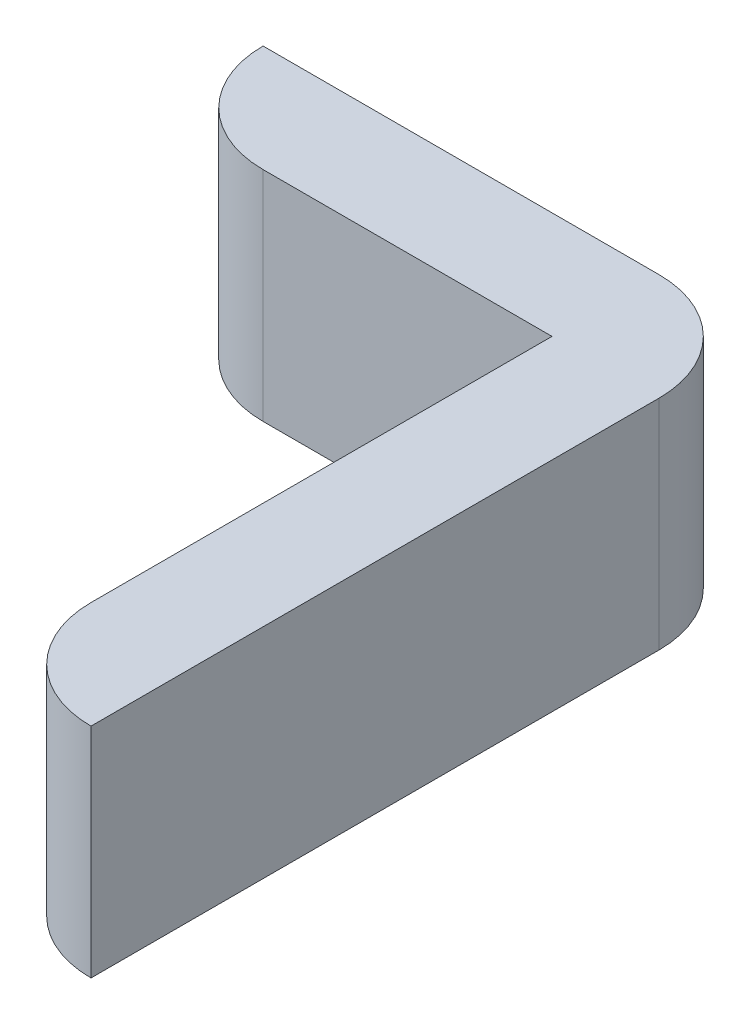
ISO-10303-21;
HEADER;
FILE_DESCRIPTION(('STEP AP214'),'2;1');
FILE_NAME('part.step','',(''),(''),'','','');
FILE_SCHEMA(('AUTOMOTIVE_DESIGN { 1 0 10303 214 1 1 1 1 }'));
ENDSEC;
DATA;
#1=APPLICATION_CONTEXT('core data for automotive mechanical design processes');
#2=APPLICATION_PROTOCOL_DEFINITION('international standard','automotive_design',2000,#1);
#3=PRODUCT_CONTEXT('',#1,'mechanical');
#4=PRODUCT('Part','Part','',(#3));
#5=PRODUCT_RELATED_PRODUCT_CATEGORY('part','',(#4));
#6=PRODUCT_DEFINITION_FORMATION('','',#4);
#7=PRODUCT_DEFINITION_CONTEXT('part definition',#1,'design');
#8=PRODUCT_DEFINITION('design','',#6,#7);
#9=PRODUCT_DEFINITION_SHAPE('','',#8);
#10=(LENGTH_UNIT() NAMED_UNIT(*) SI_UNIT(.MILLI.,.METRE.));
#11=(NAMED_UNIT(*) PLANE_ANGLE_UNIT() SI_UNIT($,.RADIAN.));
#12=(NAMED_UNIT(*) SI_UNIT($,.STERADIAN.) SOLID_ANGLE_UNIT());
#13=UNCERTAINTY_MEASURE_WITH_UNIT(LENGTH_MEASURE(1.E-05),#10,'distance_accuracy_value','');
#14=(GEOMETRIC_REPRESENTATION_CONTEXT(3) GLOBAL_UNCERTAINTY_ASSIGNED_CONTEXT((#13)) GLOBAL_UNIT_ASSIGNED_CONTEXT((#10,
#11,#12)) REPRESENTATION_CONTEXT('',''));
#15=CARTESIAN_POINT('',(0.,0.,0.));
#16=DIRECTION('',(0.,0.,1.));
#17=DIRECTION('',(1.,0.,0.));
#18=AXIS2_PLACEMENT_3D('',#15,#16,#17);
#19=CARTESIAN_POINT('',(-0.125,6.6048,0.));
#20=DIRECTION('',(0.,-1.,0.));
#21=DIRECTION('',(0.,0.,-1.));
#22=AXIS2_PLACEMENT_3D('',#19,#20,#21);
#23=PLANE('',#22);
#24=DIRECTION('',(-1.,0.,0.));
#25=VECTOR('',#24,1.);
#26=CARTESIAN_POINT('',(0.125,6.6048,0.25));
#27=LINE('',#26,#25);
#28=CARTESIAN_POINT('',(0.125,6.6048,0.25));
#29=VERTEX_POINT('',#28);
#30=CARTESIAN_POINT('',(0.8,6.6048,0.25));
#31=VERTEX_POINT('',#30);
#32=EDGE_CURVE('E102',#29,#31,#27,.F.);
#33=ORIENTED_EDGE('',*,*,#32,.T.);
#34=DIRECTION('',(0.,0.,-1.));
#35=VECTOR('',#34,1.);
#36=CARTESIAN_POINT('',(0.8,6.6048,0.25));
#37=LINE('',#36,#35);
#38=CARTESIAN_POINT('',(0.8,6.6048,1.327));
#39=VERTEX_POINT('',#38);
#40=EDGE_CURVE('E108',#31,#39,#37,.F.);
#41=ORIENTED_EDGE('',*,*,#40,.T.);
#42=CARTESIAN_POINT('',(1.05,6.6048,1.327));
#43=DIRECTION('',(0.,-1.,0.));
#44=DIRECTION('',(0.,0.,-1.));
#45=AXIS2_PLACEMENT_3D('',#42,#43,#44);
#46=CIRCLE('',#45,0.25);
#47=CARTESIAN_POINT('',(1.05,6.6048,1.577));
#48=VERTEX_POINT('',#47);
#49=EDGE_CURVE('E80',#48,#39,#46,.T.);
#50=ORIENTED_EDGE('',*,*,#49,.F.);
#51=DIRECTION('',(0.,0.,1.));
#52=VECTOR('',#51,1.);
#53=CARTESIAN_POINT('',(1.05,6.6048,1.577));
#54=LINE('',#53,#52);
#55=CARTESIAN_POINT('',(1.05,6.6048,0.25));
#56=VERTEX_POINT('',#55);
#57=EDGE_CURVE('E75',#48,#56,#54,.F.);
#58=ORIENTED_EDGE('',*,*,#57,.T.);
#59=CARTESIAN_POINT('',(0.8,6.6048,0.25));
#60=DIRECTION('',(0.,-1.,0.));
#61=DIRECTION('',(0.,0.,-1.));
#62=AXIS2_PLACEMENT_3D('',#59,#60,#61);
#63=CIRCLE('',#62,0.25);
#64=CARTESIAN_POINT('',(0.8,6.6048,0.));
#65=VERTEX_POINT('',#64);
#66=EDGE_CURVE('E19',#65,#56,#63,.T.);
#67=ORIENTED_EDGE('',*,*,#66,.F.);
#68=DIRECTION('',(1.,0.,0.));
#69=VECTOR('',#68,1.);
#70=CARTESIAN_POINT('',(0.8,6.6048,0.));
#71=LINE('',#70,#69);
#72=CARTESIAN_POINT('',(-0.125,6.6048,0.));
#73=VERTEX_POINT('',#72);
#74=EDGE_CURVE('E70',#65,#73,#71,.F.);
#75=ORIENTED_EDGE('',*,*,#74,.T.);
#76=CARTESIAN_POINT('',(0.125,6.6048,0.));
#77=DIRECTION('',(0.,-1.,0.));
#78=DIRECTION('',(0.,0.,-1.));
#79=AXIS2_PLACEMENT_3D('',#76,#77,#78);
#80=CIRCLE('',#79,0.25);
#81=EDGE_CURVE('E121',#29,#73,#80,.T.);
#82=ORIENTED_EDGE('',*,*,#81,.F.);
#83=EDGE_LOOP('',(#33,#41,#50,#58,#67,#75,#82));
#84=FACE_BOUND('',#83,.T.);
#85=ADVANCED_FACE('F16',(#84),#23,.F.);
#86=CARTESIAN_POINT('',(0.8,6.0952,0.));
#87=DIRECTION('',(0.,0.,1.));
#88=DIRECTION('',(1.,0.,0.));
#89=AXIS2_PLACEMENT_3D('',#86,#87,#88);
#90=PLANE('',#89);
#91=DIRECTION('',(0.,-1.,0.));
#92=VECTOR('',#91,1.);
#93=CARTESIAN_POINT('',(-0.125,6.0952,0.));
#94=LINE('',#93,#92);
#95=CARTESIAN_POINT('',(-0.125,6.0952,0.));
#96=VERTEX_POINT('',#95);
#97=EDGE_CURVE('E123',#73,#96,#94,.T.);
#98=ORIENTED_EDGE('',*,*,#97,.F.);
#99=ORIENTED_EDGE('',*,*,#74,.F.);
#100=DIRECTION('',(0.,-1.,0.));
#101=VECTOR('',#100,1.);
#102=CARTESIAN_POINT('',(0.8,6.0952,0.));
#103=LINE('',#102,#101);
#104=CARTESIAN_POINT('',(0.8,6.0952,0.));
#105=VERTEX_POINT('',#104);
#106=EDGE_CURVE('E92',#105,#65,#103,.F.);
#107=ORIENTED_EDGE('',*,*,#106,.F.);
#108=DIRECTION('',(1.,0.,0.));
#109=VECTOR('',#108,1.);
#110=CARTESIAN_POINT('',(-0.125,6.0952,0.));
#111=LINE('',#110,#109);
#112=EDGE_CURVE('E120',#96,#105,#111,.T.);
#113=ORIENTED_EDGE('',*,*,#112,.F.);
#114=EDGE_LOOP('',(#98,#99,#107,#113));
#115=FACE_BOUND('',#114,.T.);
#116=ADVANCED_FACE('F158',(#115),#90,.F.);
#117=CARTESIAN_POINT('',(0.8,6.0952,0.25));
#118=DIRECTION('',(0.,-1.,0.));
#119=DIRECTION('',(0.,0.,-1.));
#120=AXIS2_PLACEMENT_3D('',#117,#118,#119);
#121=CYLINDRICAL_SURFACE('',#120,0.25);
#122=ORIENTED_EDGE('',*,*,#66,.T.);
#123=DIRECTION('',(0.,1.,0.));
#124=VECTOR('',#123,1.);
#125=CARTESIAN_POINT('',(1.05,6.0952,0.25));
#126=LINE('',#125,#124);
#127=CARTESIAN_POINT('',(1.05,6.0952,0.25));
#128=VERTEX_POINT('',#127);
#129=EDGE_CURVE('E86',#56,#128,#126,.F.);
#130=ORIENTED_EDGE('',*,*,#129,.T.);
#131=CARTESIAN_POINT('',(0.8,6.0952,0.25));
#132=DIRECTION('',(0.,-1.,0.));
#133=DIRECTION('',(0.,0.,-1.));
#134=AXIS2_PLACEMENT_3D('',#131,#132,#133);
#135=CIRCLE('',#134,0.25);
#136=EDGE_CURVE('E118',#105,#128,#135,.T.);
#137=ORIENTED_EDGE('',*,*,#136,.F.);
#138=ORIENTED_EDGE('',*,*,#106,.T.);
#139=EDGE_LOOP('',(#122,#130,#137,#138));
#140=FACE_BOUND('',#139,.T.);
#141=ADVANCED_FACE('F89',(#140),#121,.T.);
#142=CARTESIAN_POINT('',(1.05,6.0952,1.577));
#143=DIRECTION('',(-1.,0.,0.));
#144=DIRECTION('',(0.,0.,1.));
#145=AXIS2_PLACEMENT_3D('',#142,#143,#144);
#146=PLANE('',#145);
#147=DIRECTION('',(0.,-1.,0.));
#148=VECTOR('',#147,1.);
#149=CARTESIAN_POINT('',(1.05,6.0952,1.577));
#150=LINE('',#149,#148);
#151=CARTESIAN_POINT('',(1.05,6.0952,1.577));
#152=VERTEX_POINT('',#151);
#153=EDGE_CURVE('E85',#152,#48,#150,.F.);
#154=ORIENTED_EDGE('',*,*,#153,.F.);
#155=DIRECTION('',(0.,0.,-1.));
#156=VECTOR('',#155,1.);
#157=CARTESIAN_POINT('',(1.05,6.0952,0.));
#158=LINE('',#157,#156);
#159=EDGE_CURVE('E94',#128,#152,#158,.F.);
#160=ORIENTED_EDGE('',*,*,#159,.F.);
#161=ORIENTED_EDGE('',*,*,#129,.F.);
#162=ORIENTED_EDGE('',*,*,#57,.F.);
#163=EDGE_LOOP('',(#154,#160,#161,#162));
#164=FACE_BOUND('',#163,.T.);
#165=ADVANCED_FACE('F93',(#164),#146,.F.);
#166=CARTESIAN_POINT('',(1.05,6.0952,1.327));
#167=DIRECTION('',(0.,-1.,0.));
#168=DIRECTION('',(0.,0.,-1.));
#169=AXIS2_PLACEMENT_3D('',#166,#167,#168);
#170=CYLINDRICAL_SURFACE('',#169,0.25);
#171=ORIENTED_EDGE('',*,*,#49,.T.);
#172=DIRECTION('',(0.,1.,0.));
#173=VECTOR('',#172,1.);
#174=CARTESIAN_POINT('',(0.8,6.0952,1.327));
#175=LINE('',#174,#173);
#176=CARTESIAN_POINT('',(0.8,6.0952,1.327));
#177=VERTEX_POINT('',#176);
#178=EDGE_CURVE('E105',#39,#177,#175,.F.);
#179=ORIENTED_EDGE('',*,*,#178,.T.);
#180=CARTESIAN_POINT('',(1.05,6.0952,1.327));
#181=DIRECTION('',(0.,-1.,0.));
#182=DIRECTION('',(0.,0.,-1.));
#183=AXIS2_PLACEMENT_3D('',#180,#181,#182);
#184=CIRCLE('',#183,0.25);
#185=EDGE_CURVE('E114',#152,#177,#184,.T.);
#186=ORIENTED_EDGE('',*,*,#185,.F.);
#187=ORIENTED_EDGE('',*,*,#153,.T.);
#188=EDGE_LOOP('',(#171,#179,#186,#187));
#189=FACE_BOUND('',#188,.T.);
#190=ADVANCED_FACE('F127',(#189),#170,.T.);
#191=CARTESIAN_POINT('',(0.8,6.0952,0.25));
#192=DIRECTION('',(1.,0.,0.));
#193=DIRECTION('',(0.,0.,-1.));
#194=AXIS2_PLACEMENT_3D('',#191,#192,#193);
#195=PLANE('',#194);
#196=ORIENTED_EDGE('',*,*,#178,.F.);
#197=ORIENTED_EDGE('',*,*,#40,.F.);
#198=DIRECTION('',(0.,1.,0.));
#199=VECTOR('',#198,1.);
#200=CARTESIAN_POINT('',(0.8,6.0952,0.25));
#201=LINE('',#200,#199);
#202=CARTESIAN_POINT('',(0.8,6.0952,0.25));
#203=VERTEX_POINT('',#202);
#204=EDGE_CURVE('E104',#31,#203,#201,.F.);
#205=ORIENTED_EDGE('',*,*,#204,.T.);
#206=DIRECTION('',(0.,0.,-1.));
#207=VECTOR('',#206,1.);
#208=CARTESIAN_POINT('',(0.8,6.0952,0.));
#209=LINE('',#208,#207);
#210=EDGE_CURVE('E117',#177,#203,#209,.T.);
#211=ORIENTED_EDGE('',*,*,#210,.F.);
#212=EDGE_LOOP('',(#196,#197,#205,#211));
#213=FACE_BOUND('',#212,.T.);
#214=ADVANCED_FACE('F150',(#213),#195,.F.);
#215=CARTESIAN_POINT('',(0.125,6.0952,0.25));
#216=DIRECTION('',(0.,0.,-1.));
#217=DIRECTION('',(-1.,0.,0.));
#218=AXIS2_PLACEMENT_3D('',#215,#216,#217);
#219=PLANE('',#218);
#220=ORIENTED_EDGE('',*,*,#204,.F.);
#221=ORIENTED_EDGE('',*,*,#32,.F.);
#222=DIRECTION('',(0.,-1.,0.));
#223=VECTOR('',#222,1.);
#224=CARTESIAN_POINT('',(0.125,6.0952,0.25));
#225=LINE('',#224,#223);
#226=CARTESIAN_POINT('',(0.125,6.0952,0.25));
#227=VERTEX_POINT('',#226);
#228=EDGE_CURVE('E34',#227,#29,#225,.F.);
#229=ORIENTED_EDGE('',*,*,#228,.F.);
#230=DIRECTION('',(1.,0.,0.));
#231=VECTOR('',#230,1.);
#232=CARTESIAN_POINT('',(-0.125,6.0952,0.25));
#233=LINE('',#232,#231);
#234=EDGE_CURVE('E25',#203,#227,#233,.F.);
#235=ORIENTED_EDGE('',*,*,#234,.F.);
#236=EDGE_LOOP('',(#220,#221,#229,#235));
#237=FACE_BOUND('',#236,.T.);
#238=ADVANCED_FACE('F151',(#237),#219,.F.);
#239=CARTESIAN_POINT('',(0.125,6.0952,0.));
#240=DIRECTION('',(0.,-1.,0.));
#241=DIRECTION('',(0.,0.,-1.));
#242=AXIS2_PLACEMENT_3D('',#239,#240,#241);
#243=CYLINDRICAL_SURFACE('',#242,0.25);
#244=ORIENTED_EDGE('',*,*,#81,.T.);
#245=ORIENTED_EDGE('',*,*,#97,.T.);
#246=CARTESIAN_POINT('',(0.125,6.0952,0.));
#247=DIRECTION('',(0.,-1.,0.));
#248=DIRECTION('',(0.,0.,-1.));
#249=AXIS2_PLACEMENT_3D('',#246,#247,#248);
#250=CIRCLE('',#249,0.25);
#251=EDGE_CURVE('E11',#227,#96,#250,.T.);
#252=ORIENTED_EDGE('',*,*,#251,.F.);
#253=ORIENTED_EDGE('',*,*,#228,.T.);
#254=EDGE_LOOP('',(#244,#245,#252,#253));
#255=FACE_BOUND('',#254,.T.);
#256=ADVANCED_FACE('F156',(#255),#243,.T.);
#257=CARTESIAN_POINT('',(-0.125,6.0952,0.));
#258=DIRECTION('',(0.,-1.,0.));
#259=DIRECTION('',(0.,0.,-1.));
#260=AXIS2_PLACEMENT_3D('',#257,#258,#259);
#261=PLANE('',#260);
#262=ORIENTED_EDGE('',*,*,#234,.T.);
#263=ORIENTED_EDGE('',*,*,#251,.T.);
#264=ORIENTED_EDGE('',*,*,#112,.T.);
#265=ORIENTED_EDGE('',*,*,#136,.T.);
#266=ORIENTED_EDGE('',*,*,#159,.T.);
#267=ORIENTED_EDGE('',*,*,#185,.T.);
#268=ORIENTED_EDGE('',*,*,#210,.T.);
#269=EDGE_LOOP('',(#262,#263,#264,#265,#266,#267,#268));
#270=FACE_BOUND('',#269,.T.);
#271=ADVANCED_FACE('F132',(#270),#261,.T.);
#272=CLOSED_SHELL('',(#85,#116,#141,#165,#190,#214,#238,#256,#271));
#273=MANIFOLD_SOLID_BREP('B1',#272);
#274=ADVANCED_BREP_SHAPE_REPRESENTATION('',(#18,#273),#14);
#275=SHAPE_DEFINITION_REPRESENTATION(#9,#274);
ENDSEC;
END-ISO-10303-21;
